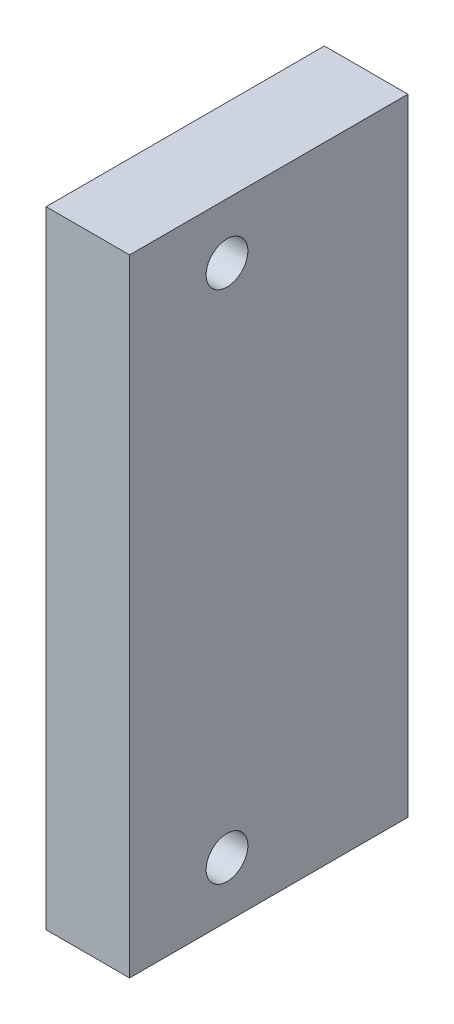
ISO-10303-21;
HEADER;
FILE_DESCRIPTION(('STEP AP214'),'2;1');
FILE_NAME('part.step','',(''),(''),'','','');
FILE_SCHEMA(('AUTOMOTIVE_DESIGN { 1 0 10303 214 1 1 1 1 }'));
ENDSEC;
DATA;
#1=APPLICATION_CONTEXT('core data for automotive mechanical design processes');
#2=APPLICATION_PROTOCOL_DEFINITION('international standard','automotive_design',2000,#1);
#3=PRODUCT_CONTEXT('',#1,'mechanical');
#4=PRODUCT('Part','Part','',(#3));
#5=PRODUCT_RELATED_PRODUCT_CATEGORY('part','',(#4));
#6=PRODUCT_DEFINITION_FORMATION('','',#4);
#7=PRODUCT_DEFINITION_CONTEXT('part definition',#1,'design');
#8=PRODUCT_DEFINITION('design','',#6,#7);
#9=PRODUCT_DEFINITION_SHAPE('','',#8);
#10=(LENGTH_UNIT() NAMED_UNIT(*) SI_UNIT(.MILLI.,.METRE.));
#11=(NAMED_UNIT(*) PLANE_ANGLE_UNIT() SI_UNIT($,.RADIAN.));
#12=(NAMED_UNIT(*) SI_UNIT($,.STERADIAN.) SOLID_ANGLE_UNIT());
#13=UNCERTAINTY_MEASURE_WITH_UNIT(LENGTH_MEASURE(1.E-05),#10,'distance_accuracy_value','');
#14=(GEOMETRIC_REPRESENTATION_CONTEXT(3) GLOBAL_UNCERTAINTY_ASSIGNED_CONTEXT((#13)) GLOBAL_UNIT_ASSIGNED_CONTEXT((#10,
#11,#12)) REPRESENTATION_CONTEXT('',''));
#15=CARTESIAN_POINT('',(0.,0.,0.));
#16=DIRECTION('',(0.,0.,1.));
#17=DIRECTION('',(1.,0.,0.));
#18=AXIS2_PLACEMENT_3D('',#15,#16,#17);
#19=CARTESIAN_POINT('',(-13.,22.5,20.));
#20=DIRECTION('',(1.,0.,0.));
#21=DIRECTION('',(0.,1.,0.));
#22=AXIS2_PLACEMENT_3D('',#19,#20,#21);
#23=PLANE('',#22);
#24=DIRECTION('',(0.,-1.,0.));
#25=VECTOR('',#24,1.);
#26=CARTESIAN_POINT('',(-13.,22.5,0.));
#27=LINE('',#26,#25);
#28=CARTESIAN_POINT('',(-13.,22.5,0.));
#29=VERTEX_POINT('',#28);
#30=CARTESIAN_POINT('',(-13.,-22.5,0.));
#31=VERTEX_POINT('',#30);
#32=EDGE_CURVE('E67',#29,#31,#27,.T.);
#33=ORIENTED_EDGE('',*,*,#32,.T.);
#34=DIRECTION('',(0.,0.,-1.));
#35=VECTOR('',#34,1.);
#36=CARTESIAN_POINT('',(-13.,-22.5,20.));
#37=LINE('',#36,#35);
#38=CARTESIAN_POINT('',(-13.,-22.5,20.));
#39=VERTEX_POINT('',#38);
#40=EDGE_CURVE('E43',#39,#31,#37,.T.);
#41=ORIENTED_EDGE('',*,*,#40,.F.);
#42=DIRECTION('',(0.,-1.,0.));
#43=VECTOR('',#42,1.);
#44=CARTESIAN_POINT('',(-13.,22.5,20.));
#45=LINE('',#44,#43);
#46=CARTESIAN_POINT('',(-13.,22.5,20.));
#47=VERTEX_POINT('',#46);
#48=EDGE_CURVE('E84',#47,#39,#45,.T.);
#49=ORIENTED_EDGE('',*,*,#48,.F.);
#50=DIRECTION('',(0.,0.,-1.));
#51=VECTOR('',#50,1.);
#52=CARTESIAN_POINT('',(-13.,22.5,20.));
#53=LINE('',#52,#51);
#54=EDGE_CURVE('E11',#47,#29,#53,.T.);
#55=ORIENTED_EDGE('',*,*,#54,.T.);
#56=EDGE_LOOP('',(#33,#41,#49,#55));
#57=FACE_BOUND('',#56,.T.);
#58=CARTESIAN_POINT('',(-13.,18.5,13.));
#59=DIRECTION('',(1.,0.,0.));
#60=DIRECTION('',(0.,1.,0.));
#61=AXIS2_PLACEMENT_3D('',#58,#59,#60);
#62=CIRCLE('',#61,1.5);
#63=CARTESIAN_POINT('',(-13.,20.,13.));
#64=VERTEX_POINT('',#63);
#65=EDGE_CURVE('E144',#64,#64,#62,.T.);
#66=ORIENTED_EDGE('',*,*,#65,.T.);
#67=EDGE_LOOP('',(#66));
#68=FACE_BOUND('',#67,.T.);
#69=CARTESIAN_POINT('',(-13.,-18.5,13.));
#70=DIRECTION('',(-1.,0.,0.));
#71=DIRECTION('',(0.,-1.,0.));
#72=AXIS2_PLACEMENT_3D('',#69,#70,#71);
#73=CIRCLE('',#72,1.5);
#74=CARTESIAN_POINT('',(-13.,-20.,13.));
#75=VERTEX_POINT('',#74);
#76=EDGE_CURVE('E142',#75,#75,#73,.T.);
#77=ORIENTED_EDGE('',*,*,#76,.F.);
#78=EDGE_LOOP('',(#77));
#79=FACE_BOUND('',#78,.T.);
#80=ADVANCED_FACE('F33',(#57,#68,#79),#23,.F.);
#81=CARTESIAN_POINT('',(-7.,22.5,20.));
#82=DIRECTION('',(1.,0.,0.));
#83=DIRECTION('',(0.,1.,0.));
#84=AXIS2_PLACEMENT_3D('',#81,#82,#83);
#85=PLANE('',#84);
#86=CARTESIAN_POINT('',(-7.,18.5,13.));
#87=DIRECTION('',(1.,0.,0.));
#88=DIRECTION('',(0.,1.,0.));
#89=AXIS2_PLACEMENT_3D('',#86,#87,#88);
#90=CIRCLE('',#89,1.5);
#91=CARTESIAN_POINT('',(-7.,20.,13.));
#92=VERTEX_POINT('',#91);
#93=EDGE_CURVE('E148',#92,#92,#90,.T.);
#94=ORIENTED_EDGE('',*,*,#93,.F.);
#95=EDGE_LOOP('',(#94));
#96=FACE_BOUND('',#95,.T.);
#97=DIRECTION('',(0.,-1.,0.));
#98=VECTOR('',#97,1.);
#99=CARTESIAN_POINT('',(-7.,22.5,0.));
#100=LINE('',#99,#98);
#101=CARTESIAN_POINT('',(-7.,22.5,0.));
#102=VERTEX_POINT('',#101);
#103=CARTESIAN_POINT('',(-7.,-22.5,0.));
#104=VERTEX_POINT('',#103);
#105=EDGE_CURVE('E104',#102,#104,#100,.T.);
#106=ORIENTED_EDGE('',*,*,#105,.F.);
#107=DIRECTION('',(0.,0.,-1.));
#108=VECTOR('',#107,1.);
#109=CARTESIAN_POINT('',(-7.,22.5,20.));
#110=LINE('',#109,#108);
#111=CARTESIAN_POINT('',(-7.,22.5,20.));
#112=VERTEX_POINT('',#111);
#113=EDGE_CURVE('E37',#112,#102,#110,.T.);
#114=ORIENTED_EDGE('',*,*,#113,.F.);
#115=DIRECTION('',(0.,-1.,0.));
#116=VECTOR('',#115,1.);
#117=CARTESIAN_POINT('',(-7.,22.5,20.));
#118=LINE('',#117,#116);
#119=CARTESIAN_POINT('',(-7.,-22.5,20.));
#120=VERTEX_POINT('',#119);
#121=EDGE_CURVE('E83',#112,#120,#118,.T.);
#122=ORIENTED_EDGE('',*,*,#121,.T.);
#123=DIRECTION('',(0.,0.,-1.));
#124=VECTOR('',#123,1.);
#125=CARTESIAN_POINT('',(-7.,-22.5,20.));
#126=LINE('',#125,#124);
#127=EDGE_CURVE('E88',#120,#104,#126,.T.);
#128=ORIENTED_EDGE('',*,*,#127,.T.);
#129=EDGE_LOOP('',(#106,#114,#122,#128));
#130=FACE_BOUND('',#129,.T.);
#131=CARTESIAN_POINT('',(-6.99999999999999,-18.5,13.));
#132=DIRECTION('',(-1.,0.,0.));
#133=DIRECTION('',(0.,-1.,0.));
#134=AXIS2_PLACEMENT_3D('',#131,#132,#133);
#135=CIRCLE('',#134,1.5);
#136=CARTESIAN_POINT('',(-6.99999999999999,-20.,13.));
#137=VERTEX_POINT('',#136);
#138=EDGE_CURVE('E105',#137,#137,#135,.T.);
#139=ORIENTED_EDGE('',*,*,#138,.T.);
#140=EDGE_LOOP('',(#139));
#141=FACE_BOUND('',#140,.T.);
#142=ADVANCED_FACE('F93',(#96,#130,#141),#85,.T.);
#143=CARTESIAN_POINT('',(-13.,22.5,20.));
#144=DIRECTION('',(0.,1.,0.));
#145=DIRECTION('',(0.,0.,1.));
#146=AXIS2_PLACEMENT_3D('',#143,#144,#145);
#147=PLANE('',#146);
#148=DIRECTION('',(1.,0.,0.));
#149=VECTOR('',#148,1.);
#150=CARTESIAN_POINT('',(-13.,22.5,0.));
#151=LINE('',#150,#149);
#152=EDGE_CURVE('E101',#29,#102,#151,.T.);
#153=ORIENTED_EDGE('',*,*,#152,.F.);
#154=ORIENTED_EDGE('',*,*,#54,.F.);
#155=DIRECTION('',(1.,0.,0.));
#156=VECTOR('',#155,1.);
#157=CARTESIAN_POINT('',(-13.,22.5,20.));
#158=LINE('',#157,#156);
#159=EDGE_CURVE('E95',#47,#112,#158,.T.);
#160=ORIENTED_EDGE('',*,*,#159,.T.);
#161=ORIENTED_EDGE('',*,*,#113,.T.);
#162=EDGE_LOOP('',(#153,#154,#160,#161));
#163=FACE_BOUND('',#162,.T.);
#164=ADVANCED_FACE('F35',(#163),#147,.T.);
#165=CARTESIAN_POINT('',(-13.,-22.5,20.));
#166=DIRECTION('',(0.,1.,0.));
#167=DIRECTION('',(0.,0.,1.));
#168=AXIS2_PLACEMENT_3D('',#165,#166,#167);
#169=PLANE('',#168);
#170=DIRECTION('',(1.,0.,0.));
#171=VECTOR('',#170,1.);
#172=CARTESIAN_POINT('',(-13.,-22.5,0.));
#173=LINE('',#172,#171);
#174=EDGE_CURVE('E91',#31,#104,#173,.T.);
#175=ORIENTED_EDGE('',*,*,#174,.T.);
#176=ORIENTED_EDGE('',*,*,#127,.F.);
#177=DIRECTION('',(1.,0.,0.));
#178=VECTOR('',#177,1.);
#179=CARTESIAN_POINT('',(-13.,-22.5,20.));
#180=LINE('',#179,#178);
#181=EDGE_CURVE('E79',#39,#120,#180,.T.);
#182=ORIENTED_EDGE('',*,*,#181,.F.);
#183=ORIENTED_EDGE('',*,*,#40,.T.);
#184=EDGE_LOOP('',(#175,#176,#182,#183));
#185=FACE_BOUND('',#184,.T.);
#186=ADVANCED_FACE('F89',(#185),#169,.F.);
#187=CARTESIAN_POINT('',(0.,0.,20.));
#188=DIRECTION('',(0.,0.,-1.));
#189=DIRECTION('',(-1.,0.,0.));
#190=AXIS2_PLACEMENT_3D('',#187,#188,#189);
#191=PLANE('',#190);
#192=ORIENTED_EDGE('',*,*,#159,.F.);
#193=ORIENTED_EDGE('',*,*,#48,.T.);
#194=ORIENTED_EDGE('',*,*,#181,.T.);
#195=ORIENTED_EDGE('',*,*,#121,.F.);
#196=EDGE_LOOP('',(#192,#193,#194,#195));
#197=FACE_BOUND('',#196,.T.);
#198=ADVANCED_FACE('F82',(#197),#191,.F.);
#199=CARTESIAN_POINT('',(0.,0.,0.));
#200=DIRECTION('',(0.,0.,-1.));
#201=DIRECTION('',(-1.,0.,0.));
#202=AXIS2_PLACEMENT_3D('',#199,#200,#201);
#203=PLANE('',#202);
#204=ORIENTED_EDGE('',*,*,#152,.T.);
#205=ORIENTED_EDGE('',*,*,#105,.T.);
#206=ORIENTED_EDGE('',*,*,#174,.F.);
#207=ORIENTED_EDGE('',*,*,#32,.F.);
#208=EDGE_LOOP('',(#204,#205,#206,#207));
#209=FACE_BOUND('',#208,.T.);
#210=ADVANCED_FACE('F110',(#209),#203,.T.);
#211=CARTESIAN_POINT('',(-7.,18.5,13.));
#212=DIRECTION('',(-1.,0.,0.));
#213=DIRECTION('',(0.,-1.,0.));
#214=AXIS2_PLACEMENT_3D('',#211,#212,#213);
#215=CYLINDRICAL_SURFACE('',#214,1.5);
#216=ORIENTED_EDGE('',*,*,#93,.T.);
#217=EDGE_LOOP('',(#216));
#218=FACE_BOUND('',#217,.T.);
#219=ORIENTED_EDGE('',*,*,#65,.F.);
#220=EDGE_LOOP('',(#219));
#221=FACE_BOUND('',#220,.T.);
#222=ADVANCED_FACE('F126',(#218,#221),#215,.F.);
#223=CARTESIAN_POINT('',(-6.99999999999999,-18.5,13.));
#224=DIRECTION('',(-1.,0.,0.));
#225=DIRECTION('',(0.,-1.,0.));
#226=AXIS2_PLACEMENT_3D('',#223,#224,#225);
#227=CYLINDRICAL_SURFACE('',#226,1.5);
#228=ORIENTED_EDGE('',*,*,#138,.F.);
#229=EDGE_LOOP('',(#228));
#230=FACE_BOUND('',#229,.T.);
#231=ORIENTED_EDGE('',*,*,#76,.T.);
#232=EDGE_LOOP('',(#231));
#233=FACE_BOUND('',#232,.T.);
#234=ADVANCED_FACE('F131',(#230,#233),#227,.F.);
#235=CLOSED_SHELL('',(#80,#142,#164,#186,#198,#210,#222,#234));
#236=MANIFOLD_SOLID_BREP('B2',#235);
#237=ADVANCED_BREP_SHAPE_REPRESENTATION('',(#18,#236),#14);
#238=SHAPE_DEFINITION_REPRESENTATION(#9,#237);
ENDSEC;
END-ISO-10303-21;
